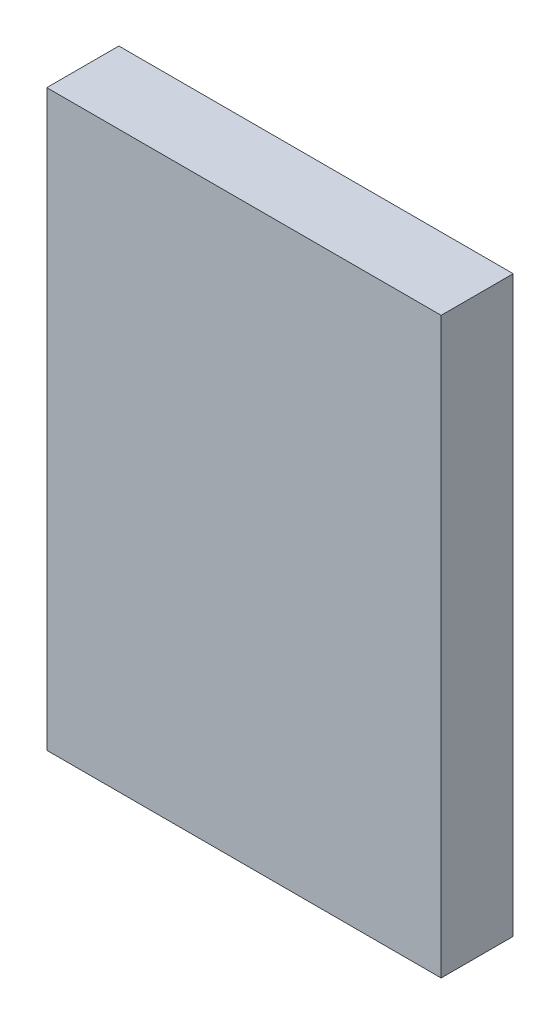
ISO-10303-21;
HEADER;
FILE_DESCRIPTION(('STEP AP214'),'2;1');
FILE_NAME('part.step','',(''),(''),'','','');
FILE_SCHEMA(('AUTOMOTIVE_DESIGN { 1 0 10303 214 1 1 1 1 }'));
ENDSEC;
DATA;
#1=APPLICATION_CONTEXT('core data for automotive mechanical design processes');
#2=APPLICATION_PROTOCOL_DEFINITION('international standard','automotive_design',2000,#1);
#3=PRODUCT_CONTEXT('',#1,'mechanical');
#4=PRODUCT('Part','Part','',(#3));
#5=PRODUCT_RELATED_PRODUCT_CATEGORY('part','',(#4));
#6=PRODUCT_DEFINITION_FORMATION('','',#4);
#7=PRODUCT_DEFINITION_CONTEXT('part definition',#1,'design');
#8=PRODUCT_DEFINITION('design','',#6,#7);
#9=PRODUCT_DEFINITION_SHAPE('','',#8);
#10=(LENGTH_UNIT() NAMED_UNIT(*) SI_UNIT(.MILLI.,.METRE.));
#11=(NAMED_UNIT(*) PLANE_ANGLE_UNIT() SI_UNIT($,.RADIAN.));
#12=(NAMED_UNIT(*) SI_UNIT($,.STERADIAN.) SOLID_ANGLE_UNIT());
#13=UNCERTAINTY_MEASURE_WITH_UNIT(LENGTH_MEASURE(1.E-05),#10,'distance_accuracy_value','');
#14=(GEOMETRIC_REPRESENTATION_CONTEXT(3) GLOBAL_UNCERTAINTY_ASSIGNED_CONTEXT((#13)) GLOBAL_UNIT_ASSIGNED_CONTEXT((#10,
#11,#12)) REPRESENTATION_CONTEXT('',''));
#15=CARTESIAN_POINT('',(0.,0.,0.));
#16=DIRECTION('',(0.,0.,1.));
#17=DIRECTION('',(1.,0.,0.));
#18=AXIS2_PLACEMENT_3D('',#15,#16,#17);
#19=CARTESIAN_POINT('',(0.318,-1.549,0.));
#20=DIRECTION('',(0.,-1.,0.));
#21=DIRECTION('',(0.,0.,-1.));
#22=AXIS2_PLACEMENT_3D('',#19,#20,#21);
#23=PLANE('',#22);
#24=DIRECTION('',(-1.,0.,0.));
#25=VECTOR('',#24,1.);
#26=CARTESIAN_POINT('',(0.597,-1.549,0.));
#27=LINE('',#26,#25);
#28=CARTESIAN_POINT('',(0.597,-1.549,0.));
#29=VERTEX_POINT('',#28);
#30=CARTESIAN_POINT('',(0.318,-1.549,0.));
#31=VERTEX_POINT('',#30);
#32=EDGE_CURVE('E11',#29,#31,#27,.T.);
#33=ORIENTED_EDGE('',*,*,#32,.F.);
#34=DIRECTION('',(0.,0.,-1.));
#35=VECTOR('',#34,1.);
#36=CARTESIAN_POINT('',(0.597,-1.549,0.051));
#37=LINE('',#36,#35);
#38=CARTESIAN_POINT('',(0.597,-1.549,0.051));
#39=VERTEX_POINT('',#38);
#40=EDGE_CURVE('E24',#39,#29,#37,.T.);
#41=ORIENTED_EDGE('',*,*,#40,.F.);
#42=DIRECTION('',(1.,0.,0.));
#43=VECTOR('',#42,1.);
#44=CARTESIAN_POINT('',(0.318,-1.549,0.051));
#45=LINE('',#44,#43);
#46=CARTESIAN_POINT('',(0.318,-1.549,0.051));
#47=VERTEX_POINT('',#46);
#48=EDGE_CURVE('E88',#47,#39,#45,.T.);
#49=ORIENTED_EDGE('',*,*,#48,.F.);
#50=DIRECTION('',(0.,0.,1.));
#51=VECTOR('',#50,1.);
#52=CARTESIAN_POINT('',(0.318,-1.549,0.));
#53=LINE('',#52,#51);
#54=EDGE_CURVE('E77',#31,#47,#53,.T.);
#55=ORIENTED_EDGE('',*,*,#54,.F.);
#56=EDGE_LOOP('',(#33,#41,#49,#55));
#57=FACE_BOUND('',#56,.T.);
#58=ADVANCED_FACE('F17',(#57),#23,.T.);
#59=CARTESIAN_POINT('',(0.597,-1.549,0.));
#60=DIRECTION('',(1.,0.,0.));
#61=DIRECTION('',(0.,1.,0.));
#62=AXIS2_PLACEMENT_3D('',#59,#60,#61);
#63=PLANE('',#62);
#64=DIRECTION('',(0.,-1.,0.));
#65=VECTOR('',#64,1.);
#66=CARTESIAN_POINT('',(0.597,-1.143,0.));
#67=LINE('',#66,#65);
#68=CARTESIAN_POINT('',(0.597,-1.143,0.));
#69=VERTEX_POINT('',#68);
#70=EDGE_CURVE('E85',#69,#29,#67,.T.);
#71=ORIENTED_EDGE('',*,*,#70,.F.);
#72=DIRECTION('',(0.,0.,-1.));
#73=VECTOR('',#72,1.);
#74=CARTESIAN_POINT('',(0.597,-1.143,0.051));
#75=LINE('',#74,#73);
#76=CARTESIAN_POINT('',(0.597,-1.143,0.051));
#77=VERTEX_POINT('',#76);
#78=EDGE_CURVE('E83',#77,#69,#75,.T.);
#79=ORIENTED_EDGE('',*,*,#78,.F.);
#80=DIRECTION('',(0.,1.,0.));
#81=VECTOR('',#80,1.);
#82=CARTESIAN_POINT('',(0.597,-1.549,0.051));
#83=LINE('',#82,#81);
#84=EDGE_CURVE('E72',#39,#77,#83,.T.);
#85=ORIENTED_EDGE('',*,*,#84,.F.);
#86=ORIENTED_EDGE('',*,*,#40,.T.);
#87=EDGE_LOOP('',(#71,#79,#85,#86));
#88=FACE_BOUND('',#87,.T.);
#89=ADVANCED_FACE('F90',(#88),#63,.T.);
#90=CARTESIAN_POINT('',(0.597,-1.143,0.));
#91=DIRECTION('',(0.,1.,0.));
#92=DIRECTION('',(1.,0.,0.));
#93=AXIS2_PLACEMENT_3D('',#90,#91,#92);
#94=PLANE('',#93);
#95=DIRECTION('',(1.,0.,0.));
#96=VECTOR('',#95,1.);
#97=CARTESIAN_POINT('',(0.318,-1.143,0.));
#98=LINE('',#97,#96);
#99=CARTESIAN_POINT('',(0.318,-1.143,0.));
#100=VERTEX_POINT('',#99);
#101=EDGE_CURVE('E60',#100,#69,#98,.T.);
#102=ORIENTED_EDGE('',*,*,#101,.F.);
#103=DIRECTION('',(0.,0.,-1.));
#104=VECTOR('',#103,1.);
#105=CARTESIAN_POINT('',(0.318,-1.143,0.051));
#106=LINE('',#105,#104);
#107=CARTESIAN_POINT('',(0.318,-1.143,0.051));
#108=VERTEX_POINT('',#107);
#109=EDGE_CURVE('E54',#108,#100,#106,.T.);
#110=ORIENTED_EDGE('',*,*,#109,.F.);
#111=DIRECTION('',(-1.,0.,0.));
#112=VECTOR('',#111,1.);
#113=CARTESIAN_POINT('',(0.597,-1.143,0.051));
#114=LINE('',#113,#112);
#115=EDGE_CURVE('E58',#77,#108,#114,.T.);
#116=ORIENTED_EDGE('',*,*,#115,.F.);
#117=ORIENTED_EDGE('',*,*,#78,.T.);
#118=EDGE_LOOP('',(#102,#110,#116,#117));
#119=FACE_BOUND('',#118,.T.);
#120=ADVANCED_FACE('F56',(#119),#94,.T.);
#121=CARTESIAN_POINT('',(0.318,-1.143,0.));
#122=DIRECTION('',(-1.,0.,0.));
#123=DIRECTION('',(0.,0.,1.));
#124=AXIS2_PLACEMENT_3D('',#121,#122,#123);
#125=PLANE('',#124);
#126=DIRECTION('',(0.,1.,0.));
#127=VECTOR('',#126,1.);
#128=CARTESIAN_POINT('',(0.318,-1.549,0.));
#129=LINE('',#128,#127);
#130=EDGE_CURVE('E73',#31,#100,#129,.T.);
#131=ORIENTED_EDGE('',*,*,#130,.F.);
#132=ORIENTED_EDGE('',*,*,#54,.T.);
#133=DIRECTION('',(0.,-1.,0.));
#134=VECTOR('',#133,1.);
#135=CARTESIAN_POINT('',(0.318,-1.143,0.051));
#136=LINE('',#135,#134);
#137=EDGE_CURVE('E70',#108,#47,#136,.T.);
#138=ORIENTED_EDGE('',*,*,#137,.F.);
#139=ORIENTED_EDGE('',*,*,#109,.T.);
#140=EDGE_LOOP('',(#131,#132,#138,#139));
#141=FACE_BOUND('',#140,.T.);
#142=ADVANCED_FACE('F76',(#141),#125,.T.);
#143=CARTESIAN_POINT('',(0.318,-1.143,0.));
#144=DIRECTION('',(0.,0.,-1.));
#145=DIRECTION('',(0.,-1.,0.));
#146=AXIS2_PLACEMENT_3D('',#143,#144,#145);
#147=PLANE('',#146);
#148=ORIENTED_EDGE('',*,*,#101,.T.);
#149=ORIENTED_EDGE('',*,*,#70,.T.);
#150=ORIENTED_EDGE('',*,*,#32,.T.);
#151=ORIENTED_EDGE('',*,*,#130,.T.);
#152=EDGE_LOOP('',(#148,#149,#150,#151));
#153=FACE_BOUND('',#152,.T.);
#154=ADVANCED_FACE('F91',(#153),#147,.T.);
#155=CARTESIAN_POINT('',(0.318,-1.549,0.051));
#156=DIRECTION('',(0.,0.,1.));
#157=DIRECTION('',(1.,0.,0.));
#158=AXIS2_PLACEMENT_3D('',#155,#156,#157);
#159=PLANE('',#158);
#160=ORIENTED_EDGE('',*,*,#48,.T.);
#161=ORIENTED_EDGE('',*,*,#84,.T.);
#162=ORIENTED_EDGE('',*,*,#115,.T.);
#163=ORIENTED_EDGE('',*,*,#137,.T.);
#164=EDGE_LOOP('',(#160,#161,#162,#163));
#165=FACE_BOUND('',#164,.T.);
#166=ADVANCED_FACE('F69',(#165),#159,.T.);
#167=CLOSED_SHELL('',(#58,#89,#120,#142,#154,#166));
#168=MANIFOLD_SOLID_BREP('B1',#167);
#169=ADVANCED_BREP_SHAPE_REPRESENTATION('',(#18,#168),#14);
#170=SHAPE_DEFINITION_REPRESENTATION(#9,#169);
ENDSEC;
END-ISO-10303-21;
